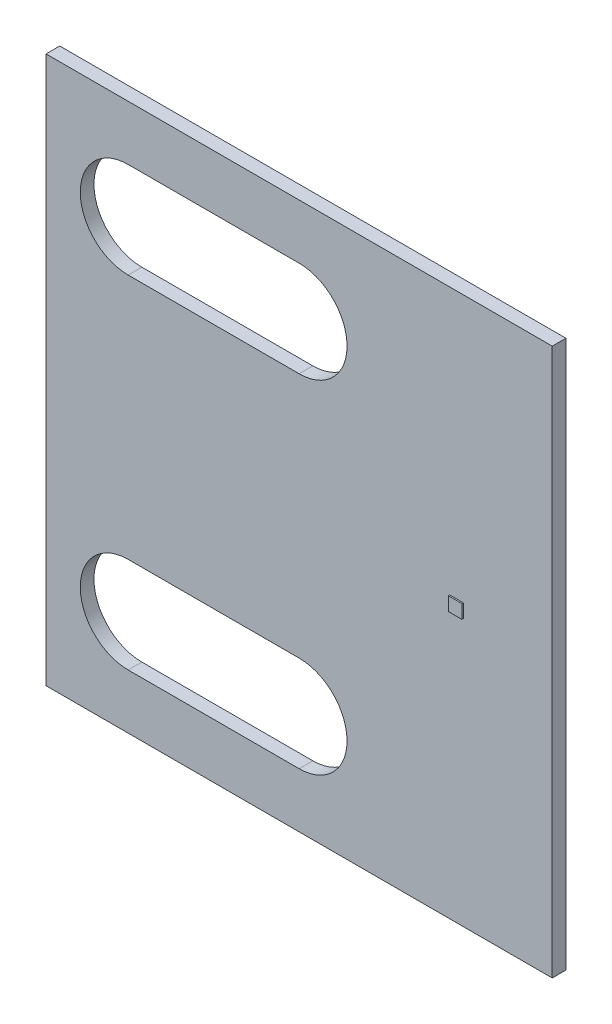
ISO-10303-21;
HEADER;
FILE_DESCRIPTION(('STEP AP214'),'2;1');
FILE_NAME('part.step','',(''),(''),'','','');
FILE_SCHEMA(('AUTOMOTIVE_DESIGN { 1 0 10303 214 1 1 1 1 }'));
ENDSEC;
DATA;
#1=APPLICATION_CONTEXT('core data for automotive mechanical design processes');
#2=APPLICATION_PROTOCOL_DEFINITION('international standard','automotive_design',2000,#1);
#3=PRODUCT_CONTEXT('',#1,'mechanical');
#4=PRODUCT('Part','Part','',(#3));
#5=PRODUCT_RELATED_PRODUCT_CATEGORY('part','',(#4));
#6=PRODUCT_DEFINITION_FORMATION('','',#4);
#7=PRODUCT_DEFINITION_CONTEXT('part definition',#1,'design');
#8=PRODUCT_DEFINITION('design','',#6,#7);
#9=PRODUCT_DEFINITION_SHAPE('','',#8);
#10=(LENGTH_UNIT() NAMED_UNIT(*) SI_UNIT(.MILLI.,.METRE.));
#11=(NAMED_UNIT(*) PLANE_ANGLE_UNIT() SI_UNIT($,.RADIAN.));
#12=(NAMED_UNIT(*) SI_UNIT($,.STERADIAN.) SOLID_ANGLE_UNIT());
#13=UNCERTAINTY_MEASURE_WITH_UNIT(LENGTH_MEASURE(1.E-05),#10,'distance_accuracy_value','');
#14=(GEOMETRIC_REPRESENTATION_CONTEXT(3) GLOBAL_UNCERTAINTY_ASSIGNED_CONTEXT((#13)) GLOBAL_UNIT_ASSIGNED_CONTEXT((#10,
#11,#12)) REPRESENTATION_CONTEXT('',''));
#15=CARTESIAN_POINT('',(0.,0.,0.));
#16=DIRECTION('',(0.,0.,1.));
#17=DIRECTION('',(1.,0.,0.));
#18=AXIS2_PLACEMENT_3D('',#15,#16,#17);
#19=CARTESIAN_POINT('',(0.,0.,1.));
#20=DIRECTION('',(0.,0.,1.));
#21=DIRECTION('',(1.,0.,0.));
#22=AXIS2_PLACEMENT_3D('',#19,#20,#21);
#23=PLANE('',#22);
#24=CARTESIAN_POINT('',(-11.5,12.5,1.));
#25=DIRECTION('',(0.,0.,1.));
#26=DIRECTION('',(-1.,0.,0.));
#27=AXIS2_PLACEMENT_3D('',#24,#25,#26);
#28=CIRCLE('',#27,3.5);
#29=CARTESIAN_POINT('',(-11.5,9.00000000000001,1.));
#30=VERTEX_POINT('',#29);
#31=CARTESIAN_POINT('',(-11.5,16.,1.));
#32=VERTEX_POINT('',#31);
#33=EDGE_CURVE('E183',#30,#32,#28,.T.);
#34=ORIENTED_EDGE('',*,*,#33,.F.);
#35=DIRECTION('',(1.,0.,0.));
#36=VECTOR('',#35,1.);
#37=CARTESIAN_POINT('',(-24.,9.00000000000001,1.));
#38=LINE('',#37,#36);
#39=CARTESIAN_POINT('',(-24.,9.00000000000001,1.));
#40=VERTEX_POINT('',#39);
#41=EDGE_CURVE('E191',#40,#30,#38,.T.);
#42=ORIENTED_EDGE('',*,*,#41,.F.);
#43=CARTESIAN_POINT('',(-24.,12.5,1.));
#44=DIRECTION('',(0.,0.,1.));
#45=DIRECTION('',(1.,0.,0.));
#46=AXIS2_PLACEMENT_3D('',#43,#44,#45);
#47=CIRCLE('',#46,3.5);
#48=CARTESIAN_POINT('',(-24.,16.,1.));
#49=VERTEX_POINT('',#48);
#50=EDGE_CURVE('E205',#49,#40,#47,.T.);
#51=ORIENTED_EDGE('',*,*,#50,.F.);
#52=DIRECTION('',(-1.,0.,0.));
#53=VECTOR('',#52,1.);
#54=CARTESIAN_POINT('',(-24.,16.,1.));
#55=LINE('',#54,#53);
#56=EDGE_CURVE('E202',#32,#49,#55,.T.);
#57=ORIENTED_EDGE('',*,*,#56,.F.);
#58=EDGE_LOOP('',(#34,#42,#51,#57));
#59=FACE_BOUND('',#58,.T.);
#60=DIRECTION('',(0.,1.,0.));
#61=VECTOR('',#60,1.);
#62=CARTESIAN_POINT('',(7.,20.,1.));
#63=LINE('',#62,#61);
#64=CARTESIAN_POINT('',(7.,-20.,1.));
#65=VERTEX_POINT('',#64);
#66=CARTESIAN_POINT('',(7.,20.,1.));
#67=VERTEX_POINT('',#66);
#68=EDGE_CURVE('E248',#65,#67,#63,.T.);
#69=ORIENTED_EDGE('',*,*,#68,.T.);
#70=DIRECTION('',(-1.,0.,0.));
#71=VECTOR('',#70,1.);
#72=CARTESIAN_POINT('',(-30.,20.,1.));
#73=LINE('',#72,#71);
#74=CARTESIAN_POINT('',(-30.,20.,1.));
#75=VERTEX_POINT('',#74);
#76=EDGE_CURVE('E251',#67,#75,#73,.T.);
#77=ORIENTED_EDGE('',*,*,#76,.T.);
#78=DIRECTION('',(0.,-1.,0.));
#79=VECTOR('',#78,1.);
#80=CARTESIAN_POINT('',(-30.,20.,1.));
#81=LINE('',#80,#79);
#82=CARTESIAN_POINT('',(-30.,-20.,1.));
#83=VERTEX_POINT('',#82);
#84=EDGE_CURVE('E254',#75,#83,#81,.T.);
#85=ORIENTED_EDGE('',*,*,#84,.T.);
#86=DIRECTION('',(1.,0.,0.));
#87=VECTOR('',#86,1.);
#88=CARTESIAN_POINT('',(-30.,-20.,1.));
#89=LINE('',#88,#87);
#90=EDGE_CURVE('E256',#83,#65,#89,.T.);
#91=ORIENTED_EDGE('',*,*,#90,.T.);
#92=EDGE_LOOP('',(#69,#77,#85,#91));
#93=FACE_BOUND('',#92,.T.);
#94=DIRECTION('',(-1.,0.,0.));
#95=VECTOR('',#94,1.);
#96=CARTESIAN_POINT('',(-0.5,0.5,1.));
#97=LINE('',#96,#95);
#98=CARTESIAN_POINT('',(0.5,0.5,1.));
#99=VERTEX_POINT('',#98);
#100=CARTESIAN_POINT('',(-0.5,0.5,1.));
#101=VERTEX_POINT('',#100);
#102=EDGE_CURVE('E232',#99,#101,#97,.T.);
#103=ORIENTED_EDGE('',*,*,#102,.F.);
#104=DIRECTION('',(0.,1.,0.));
#105=VECTOR('',#104,1.);
#106=CARTESIAN_POINT('',(0.5,-0.5,1.));
#107=LINE('',#106,#105);
#108=CARTESIAN_POINT('',(0.5,-0.5,1.));
#109=VERTEX_POINT('',#108);
#110=EDGE_CURVE('E212',#109,#99,#107,.T.);
#111=ORIENTED_EDGE('',*,*,#110,.F.);
#112=DIRECTION('',(1.,0.,0.));
#113=VECTOR('',#112,1.);
#114=CARTESIAN_POINT('',(-0.5,-0.5,1.));
#115=LINE('',#114,#113);
#116=CARTESIAN_POINT('',(-0.5,-0.5,1.));
#117=VERTEX_POINT('',#116);
#118=EDGE_CURVE('E223',#117,#109,#115,.T.);
#119=ORIENTED_EDGE('',*,*,#118,.F.);
#120=DIRECTION('',(0.,-1.,0.));
#121=VECTOR('',#120,1.);
#122=CARTESIAN_POINT('',(-0.5,-0.5,1.));
#123=LINE('',#122,#121);
#124=EDGE_CURVE('E234',#101,#117,#123,.T.);
#125=ORIENTED_EDGE('',*,*,#124,.F.);
#126=EDGE_LOOP('',(#103,#111,#119,#125));
#127=FACE_BOUND('',#126,.T.);
#128=DIRECTION('',(1.,0.,0.));
#129=VECTOR('',#128,1.);
#130=CARTESIAN_POINT('',(-24.,-9.00000000000001,1.));
#131=LINE('',#130,#129);
#132=CARTESIAN_POINT('',(-24.,-9.00000000000001,1.));
#133=VERTEX_POINT('',#132);
#134=CARTESIAN_POINT('',(-11.5,-9.00000000000001,1.));
#135=VERTEX_POINT('',#134);
#136=EDGE_CURVE('E177',#133,#135,#131,.T.);
#137=ORIENTED_EDGE('',*,*,#136,.T.);
#138=CARTESIAN_POINT('',(-11.5,-12.5,1.));
#139=DIRECTION('',(0.,0.,-1.));
#140=DIRECTION('',(-1.,0.,0.));
#141=AXIS2_PLACEMENT_3D('',#138,#139,#140);
#142=CIRCLE('',#141,3.5);
#143=CARTESIAN_POINT('',(-11.5,-16.,1.));
#144=VERTEX_POINT('',#143);
#145=EDGE_CURVE('E54',#135,#144,#142,.T.);
#146=ORIENTED_EDGE('',*,*,#145,.T.);
#147=DIRECTION('',(-1.,0.,0.));
#148=VECTOR('',#147,1.);
#149=CARTESIAN_POINT('',(-24.,-16.,1.));
#150=LINE('',#149,#148);
#151=CARTESIAN_POINT('',(-24.,-16.,1.));
#152=VERTEX_POINT('',#151);
#153=EDGE_CURVE('E168',#144,#152,#150,.T.);
#154=ORIENTED_EDGE('',*,*,#153,.T.);
#155=CARTESIAN_POINT('',(-24.,-12.5,1.));
#156=DIRECTION('',(0.,0.,-1.));
#157=DIRECTION('',(1.,0.,0.));
#158=AXIS2_PLACEMENT_3D('',#155,#156,#157);
#159=CIRCLE('',#158,3.5);
#160=EDGE_CURVE('E171',#152,#133,#159,.T.);
#161=ORIENTED_EDGE('',*,*,#160,.T.);
#162=EDGE_LOOP('',(#137,#146,#154,#161));
#163=FACE_BOUND('',#162,.T.);
#164=ADVANCED_FACE('F39',(#59,#93,#127,#163),#23,.T.);
#165=CARTESIAN_POINT('',(0.,0.,0.));
#166=DIRECTION('',(0.,0.,1.));
#167=DIRECTION('',(1.,0.,0.));
#168=AXIS2_PLACEMENT_3D('',#165,#166,#167);
#169=PLANE('',#168);
#170=DIRECTION('',(0.,1.,0.));
#171=VECTOR('',#170,1.);
#172=CARTESIAN_POINT('',(7.,20.,0.));
#173=LINE('',#172,#171);
#174=CARTESIAN_POINT('',(7.,-20.,0.));
#175=VERTEX_POINT('',#174);
#176=CARTESIAN_POINT('',(7.,20.,0.));
#177=VERTEX_POINT('',#176);
#178=EDGE_CURVE('E247',#175,#177,#173,.T.);
#179=ORIENTED_EDGE('',*,*,#178,.F.);
#180=DIRECTION('',(1.,0.,0.));
#181=VECTOR('',#180,1.);
#182=CARTESIAN_POINT('',(-30.,-20.,0.));
#183=LINE('',#182,#181);
#184=CARTESIAN_POINT('',(-30.,-20.,0.));
#185=VERTEX_POINT('',#184);
#186=EDGE_CURVE('E252',#185,#175,#183,.T.);
#187=ORIENTED_EDGE('',*,*,#186,.F.);
#188=DIRECTION('',(0.,-1.,0.));
#189=VECTOR('',#188,1.);
#190=CARTESIAN_POINT('',(-30.,20.,0.));
#191=LINE('',#190,#189);
#192=CARTESIAN_POINT('',(-30.,20.,0.));
#193=VERTEX_POINT('',#192);
#194=EDGE_CURVE('E263',#193,#185,#191,.T.);
#195=ORIENTED_EDGE('',*,*,#194,.F.);
#196=DIRECTION('',(-1.,0.,0.));
#197=VECTOR('',#196,1.);
#198=CARTESIAN_POINT('',(-30.,20.,0.));
#199=LINE('',#198,#197);
#200=EDGE_CURVE('E261',#177,#193,#199,.T.);
#201=ORIENTED_EDGE('',*,*,#200,.F.);
#202=EDGE_LOOP('',(#179,#187,#195,#201));
#203=FACE_BOUND('',#202,.T.);
#204=DIRECTION('',(1.,0.,0.));
#205=VECTOR('',#204,1.);
#206=CARTESIAN_POINT('',(-24.,9.00000000000001,0.));
#207=LINE('',#206,#205);
#208=CARTESIAN_POINT('',(-24.,9.00000000000001,0.));
#209=VERTEX_POINT('',#208);
#210=CARTESIAN_POINT('',(-11.5,9.00000000000001,0.));
#211=VERTEX_POINT('',#210);
#212=EDGE_CURVE('E197',#209,#211,#207,.T.);
#213=ORIENTED_EDGE('',*,*,#212,.T.);
#214=CARTESIAN_POINT('',(-11.5,12.5,0.));
#215=DIRECTION('',(0.,0.,1.));
#216=DIRECTION('',(-1.,0.,0.));
#217=AXIS2_PLACEMENT_3D('',#214,#215,#216);
#218=CIRCLE('',#217,3.5);
#219=CARTESIAN_POINT('',(-11.5,16.,0.));
#220=VERTEX_POINT('',#219);
#221=EDGE_CURVE('E187',#211,#220,#218,.T.);
#222=ORIENTED_EDGE('',*,*,#221,.T.);
#223=DIRECTION('',(-1.,0.,0.));
#224=VECTOR('',#223,1.);
#225=CARTESIAN_POINT('',(-24.,16.,0.));
#226=LINE('',#225,#224);
#227=CARTESIAN_POINT('',(-24.,16.,0.));
#228=VERTEX_POINT('',#227);
#229=EDGE_CURVE('E190',#220,#228,#226,.T.);
#230=ORIENTED_EDGE('',*,*,#229,.T.);
#231=CARTESIAN_POINT('',(-24.,12.5,0.));
#232=DIRECTION('',(0.,0.,1.));
#233=DIRECTION('',(1.,0.,0.));
#234=AXIS2_PLACEMENT_3D('',#231,#232,#233);
#235=CIRCLE('',#234,3.5);
#236=EDGE_CURVE('E194',#228,#209,#235,.T.);
#237=ORIENTED_EDGE('',*,*,#236,.T.);
#238=EDGE_LOOP('',(#213,#222,#230,#237));
#239=FACE_BOUND('',#238,.T.);
#240=CARTESIAN_POINT('',(-11.5,-12.5,0.));
#241=DIRECTION('',(0.,0.,-1.));
#242=DIRECTION('',(-1.,0.,0.));
#243=AXIS2_PLACEMENT_3D('',#240,#241,#242);
#244=CIRCLE('',#243,3.5);
#245=CARTESIAN_POINT('',(-11.5,-9.00000000000001,0.));
#246=VERTEX_POINT('',#245);
#247=CARTESIAN_POINT('',(-11.5,-16.,0.));
#248=VERTEX_POINT('',#247);
#249=EDGE_CURVE('E160',#246,#248,#244,.T.);
#250=ORIENTED_EDGE('',*,*,#249,.F.);
#251=DIRECTION('',(1.,0.,0.));
#252=VECTOR('',#251,1.);
#253=CARTESIAN_POINT('',(-24.,-9.00000000000001,0.));
#254=LINE('',#253,#252);
#255=CARTESIAN_POINT('',(-24.,-9.00000000000001,0.));
#256=VERTEX_POINT('',#255);
#257=EDGE_CURVE('E152',#256,#246,#254,.T.);
#258=ORIENTED_EDGE('',*,*,#257,.F.);
#259=CARTESIAN_POINT('',(-24.,-12.5,0.));
#260=DIRECTION('',(0.,0.,-1.));
#261=DIRECTION('',(1.,0.,0.));
#262=AXIS2_PLACEMENT_3D('',#259,#260,#261);
#263=CIRCLE('',#262,3.5);
#264=CARTESIAN_POINT('',(-24.,-16.,0.));
#265=VERTEX_POINT('',#264);
#266=EDGE_CURVE('E159',#265,#256,#263,.T.);
#267=ORIENTED_EDGE('',*,*,#266,.F.);
#268=DIRECTION('',(-1.,0.,0.));
#269=VECTOR('',#268,1.);
#270=CARTESIAN_POINT('',(-24.,-16.,0.));
#271=LINE('',#270,#269);
#272=EDGE_CURVE('E164',#248,#265,#271,.T.);
#273=ORIENTED_EDGE('',*,*,#272,.F.);
#274=EDGE_LOOP('',(#250,#258,#267,#273));
#275=FACE_BOUND('',#274,.T.);
#276=ADVANCED_FACE('F167',(#203,#239,#275),#169,.F.);
#277=CARTESIAN_POINT('',(7.,20.,1.));
#278=DIRECTION('',(-1.,0.,0.));
#279=DIRECTION('',(0.,-1.,0.));
#280=AXIS2_PLACEMENT_3D('',#277,#278,#279);
#281=PLANE('',#280);
#282=ORIENTED_EDGE('',*,*,#178,.T.);
#283=DIRECTION('',(0.,0.,-1.));
#284=VECTOR('',#283,1.);
#285=CARTESIAN_POINT('',(7.,20.,1.));
#286=LINE('',#285,#284);
#287=EDGE_CURVE('E11',#67,#177,#286,.T.);
#288=ORIENTED_EDGE('',*,*,#287,.F.);
#289=ORIENTED_EDGE('',*,*,#68,.F.);
#290=DIRECTION('',(0.,0.,-1.));
#291=VECTOR('',#290,1.);
#292=CARTESIAN_POINT('',(7.,-20.,1.));
#293=LINE('',#292,#291);
#294=EDGE_CURVE('E258',#65,#175,#293,.T.);
#295=ORIENTED_EDGE('',*,*,#294,.T.);
#296=EDGE_LOOP('',(#282,#288,#289,#295));
#297=FACE_BOUND('',#296,.T.);
#298=ADVANCED_FACE('F41',(#297),#281,.F.);
#299=CARTESIAN_POINT('',(-30.,20.,1.));
#300=DIRECTION('',(0.,-1.,0.));
#301=DIRECTION('',(0.,0.,-1.));
#302=AXIS2_PLACEMENT_3D('',#299,#300,#301);
#303=PLANE('',#302);
#304=ORIENTED_EDGE('',*,*,#200,.T.);
#305=DIRECTION('',(0.,0.,-1.));
#306=VECTOR('',#305,1.);
#307=CARTESIAN_POINT('',(-30.,20.,1.));
#308=LINE('',#307,#306);
#309=EDGE_CURVE('E47',#75,#193,#308,.T.);
#310=ORIENTED_EDGE('',*,*,#309,.F.);
#311=ORIENTED_EDGE('',*,*,#76,.F.);
#312=ORIENTED_EDGE('',*,*,#287,.T.);
#313=EDGE_LOOP('',(#304,#310,#311,#312));
#314=FACE_BOUND('',#313,.T.);
#315=ADVANCED_FACE('F291',(#314),#303,.F.);
#316=CARTESIAN_POINT('',(-30.,20.,1.));
#317=DIRECTION('',(1.,0.,0.));
#318=DIRECTION('',(0.,1.,0.));
#319=AXIS2_PLACEMENT_3D('',#316,#317,#318);
#320=PLANE('',#319);
#321=ORIENTED_EDGE('',*,*,#194,.T.);
#322=DIRECTION('',(0.,0.,-1.));
#323=VECTOR('',#322,1.);
#324=CARTESIAN_POINT('',(-30.,-20.,1.));
#325=LINE('',#324,#323);
#326=EDGE_CURVE('E268',#83,#185,#325,.T.);
#327=ORIENTED_EDGE('',*,*,#326,.F.);
#328=ORIENTED_EDGE('',*,*,#84,.F.);
#329=ORIENTED_EDGE('',*,*,#309,.T.);
#330=EDGE_LOOP('',(#321,#327,#328,#329));
#331=FACE_BOUND('',#330,.T.);
#332=ADVANCED_FACE('F275',(#331),#320,.F.);
#333=CARTESIAN_POINT('',(-30.,-20.,1.));
#334=DIRECTION('',(0.,1.,0.));
#335=DIRECTION('',(0.,0.,1.));
#336=AXIS2_PLACEMENT_3D('',#333,#334,#335);
#337=PLANE('',#336);
#338=ORIENTED_EDGE('',*,*,#186,.T.);
#339=ORIENTED_EDGE('',*,*,#294,.F.);
#340=ORIENTED_EDGE('',*,*,#90,.F.);
#341=ORIENTED_EDGE('',*,*,#326,.T.);
#342=EDGE_LOOP('',(#338,#339,#340,#341));
#343=FACE_BOUND('',#342,.T.);
#344=ADVANCED_FACE('F284',(#343),#337,.F.);
#345=CARTESIAN_POINT('',(0.5,-0.5,1.1));
#346=DIRECTION('',(-1.,0.,0.));
#347=DIRECTION('',(0.,0.,1.));
#348=AXIS2_PLACEMENT_3D('',#345,#346,#347);
#349=PLANE('',#348);
#350=ORIENTED_EDGE('',*,*,#110,.T.);
#351=DIRECTION('',(0.,0.,-1.));
#352=VECTOR('',#351,1.);
#353=CARTESIAN_POINT('',(0.5,0.5,1.1));
#354=LINE('',#353,#352);
#355=CARTESIAN_POINT('',(0.5,0.5,1.1));
#356=VERTEX_POINT('',#355);
#357=EDGE_CURVE('E245',#356,#99,#354,.T.);
#358=ORIENTED_EDGE('',*,*,#357,.F.);
#359=DIRECTION('',(0.,1.,0.));
#360=VECTOR('',#359,1.);
#361=CARTESIAN_POINT('',(0.5,-0.5,1.1));
#362=LINE('',#361,#360);
#363=CARTESIAN_POINT('',(0.5,-0.5,1.1));
#364=VERTEX_POINT('',#363);
#365=EDGE_CURVE('E219',#364,#356,#362,.T.);
#366=ORIENTED_EDGE('',*,*,#365,.F.);
#367=DIRECTION('',(0.,0.,-1.));
#368=VECTOR('',#367,1.);
#369=CARTESIAN_POINT('',(0.5,-0.5,1.1));
#370=LINE('',#369,#368);
#371=EDGE_CURVE('E229',#364,#109,#370,.T.);
#372=ORIENTED_EDGE('',*,*,#371,.T.);
#373=EDGE_LOOP('',(#350,#358,#366,#372));
#374=FACE_BOUND('',#373,.T.);
#375=ADVANCED_FACE('F307',(#374),#349,.F.);
#376=CARTESIAN_POINT('',(-0.5,0.5,1.1));
#377=DIRECTION('',(0.,-1.,0.));
#378=DIRECTION('',(0.,0.,-1.));
#379=AXIS2_PLACEMENT_3D('',#376,#377,#378);
#380=PLANE('',#379);
#381=ORIENTED_EDGE('',*,*,#102,.T.);
#382=DIRECTION('',(0.,0.,-1.));
#383=VECTOR('',#382,1.);
#384=CARTESIAN_POINT('',(-0.5,0.5,1.1));
#385=LINE('',#384,#383);
#386=CARTESIAN_POINT('',(-0.5,0.5,1.1));
#387=VERTEX_POINT('',#386);
#388=EDGE_CURVE('E242',#387,#101,#385,.T.);
#389=ORIENTED_EDGE('',*,*,#388,.F.);
#390=DIRECTION('',(-1.,0.,0.));
#391=VECTOR('',#390,1.);
#392=CARTESIAN_POINT('',(-0.5,0.5,1.1));
#393=LINE('',#392,#391);
#394=EDGE_CURVE('E222',#356,#387,#393,.T.);
#395=ORIENTED_EDGE('',*,*,#394,.F.);
#396=ORIENTED_EDGE('',*,*,#357,.T.);
#397=EDGE_LOOP('',(#381,#389,#395,#396));
#398=FACE_BOUND('',#397,.T.);
#399=ADVANCED_FACE('F314',(#398),#380,.F.);
#400=CARTESIAN_POINT('',(-0.5,-0.5,1.1));
#401=DIRECTION('',(1.,0.,0.));
#402=DIRECTION('',(0.,0.,-1.));
#403=AXIS2_PLACEMENT_3D('',#400,#401,#402);
#404=PLANE('',#403);
#405=ORIENTED_EDGE('',*,*,#124,.T.);
#406=DIRECTION('',(0.,0.,-1.));
#407=VECTOR('',#406,1.);
#408=CARTESIAN_POINT('',(-0.5,-0.5,1.1));
#409=LINE('',#408,#407);
#410=CARTESIAN_POINT('',(-0.5,-0.5,1.1));
#411=VERTEX_POINT('',#410);
#412=EDGE_CURVE('E240',#411,#117,#409,.T.);
#413=ORIENTED_EDGE('',*,*,#412,.F.);
#414=DIRECTION('',(0.,-1.,0.));
#415=VECTOR('',#414,1.);
#416=CARTESIAN_POINT('',(-0.5,-0.5,1.1));
#417=LINE('',#416,#415);
#418=EDGE_CURVE('E225',#387,#411,#417,.T.);
#419=ORIENTED_EDGE('',*,*,#418,.F.);
#420=ORIENTED_EDGE('',*,*,#388,.T.);
#421=EDGE_LOOP('',(#405,#413,#419,#420));
#422=FACE_BOUND('',#421,.T.);
#423=ADVANCED_FACE('F319',(#422),#404,.F.);
#424=CARTESIAN_POINT('',(-0.5,-0.5,1.1));
#425=DIRECTION('',(0.,1.,0.));
#426=DIRECTION('',(0.,0.,1.));
#427=AXIS2_PLACEMENT_3D('',#424,#425,#426);
#428=PLANE('',#427);
#429=ORIENTED_EDGE('',*,*,#118,.T.);
#430=ORIENTED_EDGE('',*,*,#371,.F.);
#431=DIRECTION('',(1.,0.,0.));
#432=VECTOR('',#431,1.);
#433=CARTESIAN_POINT('',(-0.5,-0.5,1.1));
#434=LINE('',#433,#432);
#435=EDGE_CURVE('E227',#411,#364,#434,.T.);
#436=ORIENTED_EDGE('',*,*,#435,.F.);
#437=ORIENTED_EDGE('',*,*,#412,.T.);
#438=EDGE_LOOP('',(#429,#430,#436,#437));
#439=FACE_BOUND('',#438,.T.);
#440=ADVANCED_FACE('F337',(#439),#428,.F.);
#441=CARTESIAN_POINT('',(0.,0.,1.1));
#442=DIRECTION('',(0.,0.,-1.));
#443=DIRECTION('',(-1.,0.,0.));
#444=AXIS2_PLACEMENT_3D('',#441,#442,#443);
#445=PLANE('',#444);
#446=ORIENTED_EDGE('',*,*,#365,.T.);
#447=ORIENTED_EDGE('',*,*,#394,.T.);
#448=ORIENTED_EDGE('',*,*,#418,.T.);
#449=ORIENTED_EDGE('',*,*,#435,.T.);
#450=EDGE_LOOP('',(#446,#447,#448,#449));
#451=FACE_BOUND('',#450,.T.);
#452=ADVANCED_FACE('F335',(#451),#445,.F.);
#453=CARTESIAN_POINT('',(-11.5,12.5,0.));
#454=DIRECTION('',(0.,0.,1.));
#455=DIRECTION('',(1.,0.,0.));
#456=AXIS2_PLACEMENT_3D('',#453,#454,#455);
#457=CYLINDRICAL_SURFACE('',#456,3.5);
#458=ORIENTED_EDGE('',*,*,#33,.T.);
#459=DIRECTION('',(0.,0.,1.));
#460=VECTOR('',#459,1.);
#461=CARTESIAN_POINT('',(-11.5,16.,0.));
#462=LINE('',#461,#460);
#463=EDGE_CURVE('E200',#220,#32,#462,.T.);
#464=ORIENTED_EDGE('',*,*,#463,.F.);
#465=ORIENTED_EDGE('',*,*,#221,.F.);
#466=DIRECTION('',(0.,0.,1.));
#467=VECTOR('',#466,1.);
#468=CARTESIAN_POINT('',(-11.5,9.00000000000001,0.));
#469=LINE('',#468,#467);
#470=EDGE_CURVE('E210',#211,#30,#469,.T.);
#471=ORIENTED_EDGE('',*,*,#470,.T.);
#472=EDGE_LOOP('',(#458,#464,#465,#471));
#473=FACE_BOUND('',#472,.T.);
#474=ADVANCED_FACE('F344',(#473),#457,.F.);
#475=CARTESIAN_POINT('',(-24.,9.00000000000001,0.));
#476=DIRECTION('',(0.,-1.,0.));
#477=DIRECTION('',(0.,0.,-1.));
#478=AXIS2_PLACEMENT_3D('',#475,#476,#477);
#479=PLANE('',#478);
#480=ORIENTED_EDGE('',*,*,#41,.T.);
#481=ORIENTED_EDGE('',*,*,#470,.F.);
#482=ORIENTED_EDGE('',*,*,#212,.F.);
#483=DIRECTION('',(0.,0.,1.));
#484=VECTOR('',#483,1.);
#485=CARTESIAN_POINT('',(-24.,9.00000000000001,0.));
#486=LINE('',#485,#484);
#487=EDGE_CURVE('E213',#209,#40,#486,.T.);
#488=ORIENTED_EDGE('',*,*,#487,.T.);
#489=EDGE_LOOP('',(#480,#481,#482,#488));
#490=FACE_BOUND('',#489,.T.);
#491=ADVANCED_FACE('F350',(#490),#479,.F.);
#492=CARTESIAN_POINT('',(-24.,12.5,0.));
#493=DIRECTION('',(0.,0.,1.));
#494=DIRECTION('',(1.,0.,0.));
#495=AXIS2_PLACEMENT_3D('',#492,#493,#494);
#496=CYLINDRICAL_SURFACE('',#495,3.5);
#497=ORIENTED_EDGE('',*,*,#50,.T.);
#498=ORIENTED_EDGE('',*,*,#487,.F.);
#499=ORIENTED_EDGE('',*,*,#236,.F.);
#500=DIRECTION('',(0.,0.,1.));
#501=VECTOR('',#500,1.);
#502=CARTESIAN_POINT('',(-24.,16.,0.));
#503=LINE('',#502,#501);
#504=EDGE_CURVE('E215',#228,#49,#503,.T.);
#505=ORIENTED_EDGE('',*,*,#504,.T.);
#506=EDGE_LOOP('',(#497,#498,#499,#505));
#507=FACE_BOUND('',#506,.T.);
#508=ADVANCED_FACE('F355',(#507),#496,.F.);
#509=CARTESIAN_POINT('',(-24.,16.,0.));
#510=DIRECTION('',(0.,1.,0.));
#511=DIRECTION('',(-1.,0.,0.));
#512=AXIS2_PLACEMENT_3D('',#509,#510,#511);
#513=PLANE('',#512);
#514=ORIENTED_EDGE('',*,*,#56,.T.);
#515=ORIENTED_EDGE('',*,*,#504,.F.);
#516=ORIENTED_EDGE('',*,*,#229,.F.);
#517=ORIENTED_EDGE('',*,*,#463,.T.);
#518=EDGE_LOOP('',(#514,#515,#516,#517));
#519=FACE_BOUND('',#518,.T.);
#520=ADVANCED_FACE('F352',(#519),#513,.F.);
#521=CARTESIAN_POINT('',(-11.5,-12.5,0.));
#522=DIRECTION('',(0.,0.,1.));
#523=DIRECTION('',(1.,0.,0.));
#524=AXIS2_PLACEMENT_3D('',#521,#522,#523);
#525=CYLINDRICAL_SURFACE('',#524,3.5);
#526=ORIENTED_EDGE('',*,*,#145,.F.);
#527=DIRECTION('',(0.,0.,1.));
#528=VECTOR('',#527,1.);
#529=CARTESIAN_POINT('',(-11.5,-9.00000000000001,0.));
#530=LINE('',#529,#528);
#531=EDGE_CURVE('E154',#246,#135,#530,.T.);
#532=ORIENTED_EDGE('',*,*,#531,.F.);
#533=ORIENTED_EDGE('',*,*,#249,.T.);
#534=DIRECTION('',(0.,0.,1.));
#535=VECTOR('',#534,1.);
#536=CARTESIAN_POINT('',(-11.5,-16.,0.));
#537=LINE('',#536,#535);
#538=EDGE_CURVE('E181',#248,#144,#537,.T.);
#539=ORIENTED_EDGE('',*,*,#538,.T.);
#540=EDGE_LOOP('',(#526,#532,#533,#539));
#541=FACE_BOUND('',#540,.T.);
#542=ADVANCED_FACE('F162',(#541),#525,.F.);
#543=CARTESIAN_POINT('',(-24.,-16.,0.));
#544=DIRECTION('',(0.,1.,0.));
#545=DIRECTION('',(-1.,0.,0.));
#546=AXIS2_PLACEMENT_3D('',#543,#544,#545);
#547=PLANE('',#546);
#548=ORIENTED_EDGE('',*,*,#153,.F.);
#549=ORIENTED_EDGE('',*,*,#538,.F.);
#550=ORIENTED_EDGE('',*,*,#272,.T.);
#551=DIRECTION('',(0.,0.,1.));
#552=VECTOR('',#551,1.);
#553=CARTESIAN_POINT('',(-24.,-16.,0.));
#554=LINE('',#553,#552);
#555=EDGE_CURVE('E184',#265,#152,#554,.T.);
#556=ORIENTED_EDGE('',*,*,#555,.T.);
#557=EDGE_LOOP('',(#548,#549,#550,#556));
#558=FACE_BOUND('',#557,.T.);
#559=ADVANCED_FACE('F365',(#558),#547,.T.);
#560=CARTESIAN_POINT('',(-24.,-12.5,0.));
#561=DIRECTION('',(0.,0.,1.));
#562=DIRECTION('',(1.,0.,0.));
#563=AXIS2_PLACEMENT_3D('',#560,#561,#562);
#564=CYLINDRICAL_SURFACE('',#563,3.5);
#565=ORIENTED_EDGE('',*,*,#160,.F.);
#566=ORIENTED_EDGE('',*,*,#555,.F.);
#567=ORIENTED_EDGE('',*,*,#266,.T.);
#568=DIRECTION('',(0.,0.,1.));
#569=VECTOR('',#568,1.);
#570=CARTESIAN_POINT('',(-24.,-9.00000000000001,0.));
#571=LINE('',#570,#569);
#572=EDGE_CURVE('E62',#256,#133,#571,.T.);
#573=ORIENTED_EDGE('',*,*,#572,.T.);
#574=EDGE_LOOP('',(#565,#566,#567,#573));
#575=FACE_BOUND('',#574,.T.);
#576=ADVANCED_FACE('F368',(#575),#564,.F.);
#577=CARTESIAN_POINT('',(-24.,-9.00000000000001,0.));
#578=DIRECTION('',(0.,-1.,0.));
#579=DIRECTION('',(0.,0.,-1.));
#580=AXIS2_PLACEMENT_3D('',#577,#578,#579);
#581=PLANE('',#580);
#582=ORIENTED_EDGE('',*,*,#136,.F.);
#583=ORIENTED_EDGE('',*,*,#572,.F.);
#584=ORIENTED_EDGE('',*,*,#257,.T.);
#585=ORIENTED_EDGE('',*,*,#531,.T.);
#586=EDGE_LOOP('',(#582,#583,#584,#585));
#587=FACE_BOUND('',#586,.T.);
#588=ADVANCED_FACE('F153',(#587),#581,.T.);
#589=CLOSED_SHELL('',(#164,#276,#298,#315,#332,#344,#375,#399,#423,#440,#452,#474,#491,#508,
#520,#542,#559,#576,#588));
#590=MANIFOLD_SOLID_BREP('B2',#589);
#591=ADVANCED_BREP_SHAPE_REPRESENTATION('',(#18,#590),#14);
#592=SHAPE_DEFINITION_REPRESENTATION(#9,#591);
ENDSEC;
END-ISO-10303-21;
